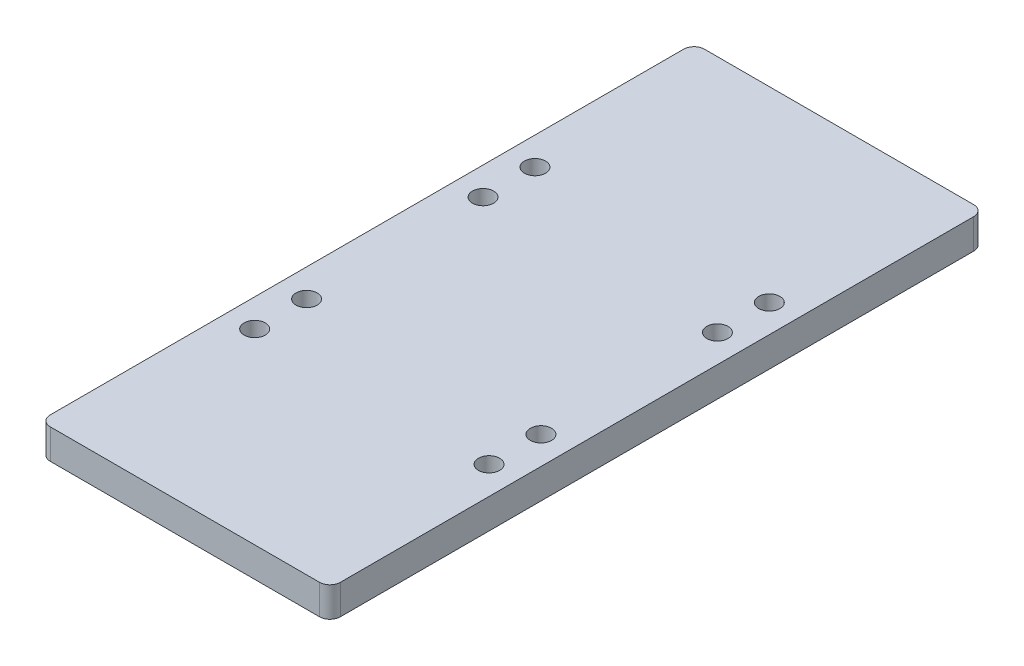
ISO-10303-21;
HEADER;
FILE_DESCRIPTION(('STEP AP214'),'2;1');
FILE_NAME('part.step','',(''),(''),'','','');
FILE_SCHEMA(('AUTOMOTIVE_DESIGN { 1 0 10303 214 1 1 1 1 }'));
ENDSEC;
DATA;
#1=APPLICATION_CONTEXT('core data for automotive mechanical design processes');
#2=APPLICATION_PROTOCOL_DEFINITION('international standard','automotive_design',2000,#1);
#3=PRODUCT_CONTEXT('',#1,'mechanical');
#4=PRODUCT('Part','Part','',(#3));
#5=PRODUCT_RELATED_PRODUCT_CATEGORY('part','',(#4));
#6=PRODUCT_DEFINITION_FORMATION('','',#4);
#7=PRODUCT_DEFINITION_CONTEXT('part definition',#1,'design');
#8=PRODUCT_DEFINITION('design','',#6,#7);
#9=PRODUCT_DEFINITION_SHAPE('','',#8);
#10=(LENGTH_UNIT() NAMED_UNIT(*) SI_UNIT(.MILLI.,.METRE.));
#11=(NAMED_UNIT(*) PLANE_ANGLE_UNIT() SI_UNIT($,.RADIAN.));
#12=(NAMED_UNIT(*) SI_UNIT($,.STERADIAN.) SOLID_ANGLE_UNIT());
#13=UNCERTAINTY_MEASURE_WITH_UNIT(LENGTH_MEASURE(1.E-05),#10,'distance_accuracy_value','');
#14=(GEOMETRIC_REPRESENTATION_CONTEXT(3) GLOBAL_UNCERTAINTY_ASSIGNED_CONTEXT((#13)) GLOBAL_UNIT_ASSIGNED_CONTEXT((#10,
#11,#12)) REPRESENTATION_CONTEXT('',''));
#15=CARTESIAN_POINT('',(0.,0.,0.));
#16=DIRECTION('',(0.,0.,1.));
#17=DIRECTION('',(1.,0.,0.));
#18=AXIS2_PLACEMENT_3D('',#15,#16,#17);
#19=CARTESIAN_POINT('',(-35.473,7.3152,80.));
#20=DIRECTION('',(1.,0.,0.));
#21=DIRECTION('',(0.,0.,-1.));
#22=AXIS2_PLACEMENT_3D('',#19,#20,#21);
#23=PLANE('',#22);
#24=DIRECTION('',(0.,0.,1.));
#25=VECTOR('',#24,1.);
#26=CARTESIAN_POINT('',(-35.473,0.,80.));
#27=LINE('',#26,#25);
#28=CARTESIAN_POINT('',(-35.473,0.,-77.46));
#29=VERTEX_POINT('',#28);
#30=CARTESIAN_POINT('',(-35.473,0.,77.46));
#31=VERTEX_POINT('',#30);
#32=EDGE_CURVE('E134',#29,#31,#27,.T.);
#33=ORIENTED_EDGE('',*,*,#32,.T.);
#34=DIRECTION('',(0.,-1.,0.));
#35=VECTOR('',#34,1.);
#36=CARTESIAN_POINT('',(-35.473,7.3152,77.46));
#37=LINE('',#36,#35);
#38=CARTESIAN_POINT('',(-35.473,7.3152,77.46));
#39=VERTEX_POINT('',#38);
#40=EDGE_CURVE('E157',#31,#39,#37,.F.);
#41=ORIENTED_EDGE('',*,*,#40,.T.);
#42=DIRECTION('',(0.,0.,1.));
#43=VECTOR('',#42,1.);
#44=CARTESIAN_POINT('',(-35.473,7.3152,80.));
#45=LINE('',#44,#43);
#46=CARTESIAN_POINT('',(-35.473,7.3152,-77.46));
#47=VERTEX_POINT('',#46);
#48=EDGE_CURVE('E132',#47,#39,#45,.T.);
#49=ORIENTED_EDGE('',*,*,#48,.F.);
#50=DIRECTION('',(0.,-1.,0.));
#51=VECTOR('',#50,1.);
#52=CARTESIAN_POINT('',(-35.473,7.3152,-77.46));
#53=LINE('',#52,#51);
#54=EDGE_CURVE('E154',#47,#29,#53,.T.);
#55=ORIENTED_EDGE('',*,*,#54,.T.);
#56=EDGE_LOOP('',(#33,#41,#49,#55));
#57=FACE_BOUND('',#56,.T.);
#58=ADVANCED_FACE('F39',(#57),#23,.F.);
#59=CARTESIAN_POINT('',(35.473,7.3152,80.));
#60=DIRECTION('',(0.,0.,-1.));
#61=DIRECTION('',(-1.,0.,0.));
#62=AXIS2_PLACEMENT_3D('',#59,#60,#61);
#63=PLANE('',#62);
#64=DIRECTION('',(1.,0.,0.));
#65=VECTOR('',#64,1.);
#66=CARTESIAN_POINT('',(35.473,0.,80.));
#67=LINE('',#66,#65);
#68=CARTESIAN_POINT('',(-32.933,0.,80.));
#69=VERTEX_POINT('',#68);
#70=CARTESIAN_POINT('',(32.933,0.,80.));
#71=VERTEX_POINT('',#70);
#72=EDGE_CURVE('E130',#69,#71,#67,.T.);
#73=ORIENTED_EDGE('',*,*,#72,.T.);
#74=DIRECTION('',(0.,-1.,0.));
#75=VECTOR('',#74,1.);
#76=CARTESIAN_POINT('',(32.933,7.3152,80.));
#77=LINE('',#76,#75);
#78=CARTESIAN_POINT('',(32.933,7.3152,80.));
#79=VERTEX_POINT('',#78);
#80=EDGE_CURVE('E109',#71,#79,#77,.F.);
#81=ORIENTED_EDGE('',*,*,#80,.T.);
#82=DIRECTION('',(1.,0.,0.));
#83=VECTOR('',#82,1.);
#84=CARTESIAN_POINT('',(35.473,7.3152,80.));
#85=LINE('',#84,#83);
#86=CARTESIAN_POINT('',(-32.933,7.3152,80.));
#87=VERTEX_POINT('',#86);
#88=EDGE_CURVE('E173',#87,#79,#85,.T.);
#89=ORIENTED_EDGE('',*,*,#88,.F.);
#90=DIRECTION('',(0.,-1.,0.));
#91=VECTOR('',#90,1.);
#92=CARTESIAN_POINT('',(-32.933,7.3152,80.));
#93=LINE('',#92,#91);
#94=EDGE_CURVE('E114',#87,#69,#93,.T.);
#95=ORIENTED_EDGE('',*,*,#94,.T.);
#96=EDGE_LOOP('',(#73,#81,#89,#95));
#97=FACE_BOUND('',#96,.T.);
#98=ADVANCED_FACE('F254',(#97),#63,.F.);
#99=CARTESIAN_POINT('',(35.473,7.3152,80.));
#100=DIRECTION('',(-1.,0.,0.));
#101=DIRECTION('',(0.,0.,1.));
#102=AXIS2_PLACEMENT_3D('',#99,#100,#101);
#103=PLANE('',#102);
#104=DIRECTION('',(0.,0.,-1.));
#105=VECTOR('',#104,1.);
#106=CARTESIAN_POINT('',(35.473,7.3152,80.));
#107=LINE('',#106,#105);
#108=CARTESIAN_POINT('',(35.473,7.3152,77.46));
#109=VERTEX_POINT('',#108);
#110=CARTESIAN_POINT('',(35.473,7.3152,-77.46));
#111=VERTEX_POINT('',#110);
#112=EDGE_CURVE('E123',#109,#111,#107,.T.);
#113=ORIENTED_EDGE('',*,*,#112,.F.);
#114=DIRECTION('',(0.,-1.,0.));
#115=VECTOR('',#114,1.);
#116=CARTESIAN_POINT('',(35.473,7.3152,77.46));
#117=LINE('',#116,#115);
#118=CARTESIAN_POINT('',(35.473,0.,77.46));
#119=VERTEX_POINT('',#118);
#120=EDGE_CURVE('E108',#109,#119,#117,.T.);
#121=ORIENTED_EDGE('',*,*,#120,.T.);
#122=DIRECTION('',(0.,0.,-1.));
#123=VECTOR('',#122,1.);
#124=CARTESIAN_POINT('',(35.473,0.,80.));
#125=LINE('',#124,#123);
#126=CARTESIAN_POINT('',(35.473,0.,-77.46));
#127=VERTEX_POINT('',#126);
#128=EDGE_CURVE('E121',#119,#127,#125,.T.);
#129=ORIENTED_EDGE('',*,*,#128,.T.);
#130=DIRECTION('',(0.,-1.,0.));
#131=VECTOR('',#130,1.);
#132=CARTESIAN_POINT('',(35.473,7.3152,-77.46));
#133=LINE('',#132,#131);
#134=EDGE_CURVE('E125',#127,#111,#133,.F.);
#135=ORIENTED_EDGE('',*,*,#134,.T.);
#136=EDGE_LOOP('',(#113,#121,#129,#135));
#137=FACE_BOUND('',#136,.T.);
#138=ADVANCED_FACE('F120',(#137),#103,.F.);
#139=CARTESIAN_POINT('',(35.473,7.3152,-80.));
#140=DIRECTION('',(0.,0.,1.));
#141=DIRECTION('',(1.,0.,0.));
#142=AXIS2_PLACEMENT_3D('',#139,#140,#141);
#143=PLANE('',#142);
#144=DIRECTION('',(-1.,0.,0.));
#145=VECTOR('',#144,1.);
#146=CARTESIAN_POINT('',(35.473,0.,-80.));
#147=LINE('',#146,#145);
#148=CARTESIAN_POINT('',(32.933,0.,-80.));
#149=VERTEX_POINT('',#148);
#150=CARTESIAN_POINT('',(-32.933,0.,-80.));
#151=VERTEX_POINT('',#150);
#152=EDGE_CURVE('E129',#149,#151,#147,.T.);
#153=ORIENTED_EDGE('',*,*,#152,.T.);
#154=DIRECTION('',(0.,-1.,0.));
#155=VECTOR('',#154,1.);
#156=CARTESIAN_POINT('',(-32.933,7.3152,-80.));
#157=LINE('',#156,#155);
#158=CARTESIAN_POINT('',(-32.933,7.3152,-80.));
#159=VERTEX_POINT('',#158);
#160=EDGE_CURVE('E11',#151,#159,#157,.F.);
#161=ORIENTED_EDGE('',*,*,#160,.T.);
#162=DIRECTION('',(-1.,0.,0.));
#163=VECTOR('',#162,1.);
#164=CARTESIAN_POINT('',(35.473,7.3152,-80.));
#165=LINE('',#164,#163);
#166=CARTESIAN_POINT('',(32.933,7.3152,-80.));
#167=VERTEX_POINT('',#166);
#168=EDGE_CURVE('E138',#167,#159,#165,.T.);
#169=ORIENTED_EDGE('',*,*,#168,.F.);
#170=DIRECTION('',(0.,-1.,0.));
#171=VECTOR('',#170,1.);
#172=CARTESIAN_POINT('',(32.933,7.3152,-80.));
#173=LINE('',#172,#171);
#174=EDGE_CURVE('E47',#167,#149,#173,.T.);
#175=ORIENTED_EDGE('',*,*,#174,.T.);
#176=EDGE_LOOP('',(#153,#161,#169,#175));
#177=FACE_BOUND('',#176,.T.);
#178=ADVANCED_FACE('F160',(#177),#143,.F.);
#179=CARTESIAN_POINT('',(0.,7.3152,0.));
#180=DIRECTION('',(0.,1.,0.));
#181=DIRECTION('',(0.,0.,1.));
#182=AXIS2_PLACEMENT_3D('',#179,#180,#181);
#183=PLANE('',#182);
#184=CARTESIAN_POINT('',(-28.6626,7.3152,-34.28));
#185=DIRECTION('',(0.,1.,0.));
#186=DIRECTION('',(0.,0.,1.));
#187=AXIS2_PLACEMENT_3D('',#184,#185,#186);
#188=CIRCLE('',#187,2.59079999999999);
#189=CARTESIAN_POINT('',(-28.6626,7.3152,-31.6892));
#190=VERTEX_POINT('',#189);
#191=EDGE_CURVE('E229',#190,#190,#188,.T.);
#192=ORIENTED_EDGE('',*,*,#191,.F.);
#193=EDGE_LOOP('',(#192));
#194=FACE_BOUND('',#193,.T.);
#195=CARTESIAN_POINT('',(-28.6626,7.3152,-21.58));
#196=DIRECTION('',(0.,1.,0.));
#197=DIRECTION('',(0.,0.,1.));
#198=AXIS2_PLACEMENT_3D('',#195,#196,#197);
#199=CIRCLE('',#198,2.59079999999999);
#200=CARTESIAN_POINT('',(-28.6626,7.3152,-18.9892));
#201=VERTEX_POINT('',#200);
#202=EDGE_CURVE('E223',#201,#201,#199,.T.);
#203=ORIENTED_EDGE('',*,*,#202,.F.);
#204=EDGE_LOOP('',(#203));
#205=FACE_BOUND('',#204,.T.);
#206=CARTESIAN_POINT('',(28.6626,7.3152,-34.28));
#207=DIRECTION('',(0.,1.,0.));
#208=DIRECTION('',(0.,0.,1.));
#209=AXIS2_PLACEMENT_3D('',#206,#207,#208);
#210=CIRCLE('',#209,2.59079999999998);
#211=CARTESIAN_POINT('',(28.6626,7.3152,-31.6892));
#212=VERTEX_POINT('',#211);
#213=EDGE_CURVE('E217',#212,#212,#210,.T.);
#214=ORIENTED_EDGE('',*,*,#213,.F.);
#215=EDGE_LOOP('',(#214));
#216=FACE_BOUND('',#215,.T.);
#217=CARTESIAN_POINT('',(28.6626,7.3152,-21.58));
#218=DIRECTION('',(0.,1.,0.));
#219=DIRECTION('',(0.,0.,1.));
#220=AXIS2_PLACEMENT_3D('',#217,#218,#219);
#221=CIRCLE('',#220,2.59079999999998);
#222=CARTESIAN_POINT('',(28.6626,7.3152,-18.9892));
#223=VERTEX_POINT('',#222);
#224=EDGE_CURVE('E211',#223,#223,#221,.T.);
#225=ORIENTED_EDGE('',*,*,#224,.F.);
#226=EDGE_LOOP('',(#225));
#227=FACE_BOUND('',#226,.T.);
#228=CARTESIAN_POINT('',(28.6626,7.3152,34.28));
#229=DIRECTION('',(0.,1.,0.));
#230=DIRECTION('',(0.,0.,1.));
#231=AXIS2_PLACEMENT_3D('',#228,#229,#230);
#232=CIRCLE('',#231,2.59079999999998);
#233=CARTESIAN_POINT('',(28.6626,7.3152,36.8708));
#234=VERTEX_POINT('',#233);
#235=EDGE_CURVE('E205',#234,#234,#232,.T.);
#236=ORIENTED_EDGE('',*,*,#235,.F.);
#237=EDGE_LOOP('',(#236));
#238=FACE_BOUND('',#237,.T.);
#239=CARTESIAN_POINT('',(28.6626,7.3152,21.58));
#240=DIRECTION('',(0.,1.,0.));
#241=DIRECTION('',(0.,0.,1.));
#242=AXIS2_PLACEMENT_3D('',#239,#240,#241);
#243=CIRCLE('',#242,2.59079999999998);
#244=CARTESIAN_POINT('',(28.6626,7.3152,24.1708));
#245=VERTEX_POINT('',#244);
#246=EDGE_CURVE('E199',#245,#245,#243,.T.);
#247=ORIENTED_EDGE('',*,*,#246,.F.);
#248=EDGE_LOOP('',(#247));
#249=FACE_BOUND('',#248,.T.);
#250=CARTESIAN_POINT('',(-28.6626,7.3152,34.28));
#251=DIRECTION('',(0.,1.,0.));
#252=DIRECTION('',(0.,0.,1.));
#253=AXIS2_PLACEMENT_3D('',#250,#251,#252);
#254=CIRCLE('',#253,2.59079999999999);
#255=CARTESIAN_POINT('',(-28.6626,7.3152,36.8708));
#256=VERTEX_POINT('',#255);
#257=EDGE_CURVE('E191',#256,#256,#254,.T.);
#258=ORIENTED_EDGE('',*,*,#257,.F.);
#259=EDGE_LOOP('',(#258));
#260=FACE_BOUND('',#259,.T.);
#261=CARTESIAN_POINT('',(-28.6626,7.3152,21.58));
#262=DIRECTION('',(0.,1.,0.));
#263=DIRECTION('',(0.,0.,1.));
#264=AXIS2_PLACEMENT_3D('',#261,#262,#263);
#265=CIRCLE('',#264,2.59079999999999);
#266=CARTESIAN_POINT('',(-28.6626,7.3152,24.1708));
#267=VERTEX_POINT('',#266);
#268=EDGE_CURVE('E183',#267,#267,#265,.T.);
#269=ORIENTED_EDGE('',*,*,#268,.F.);
#270=EDGE_LOOP('',(#269));
#271=FACE_BOUND('',#270,.T.);
#272=ORIENTED_EDGE('',*,*,#88,.T.);
#273=CARTESIAN_POINT('',(32.933,7.3152,77.46));
#274=DIRECTION('',(0.,1.,0.));
#275=DIRECTION('',(0.,0.,1.));
#276=AXIS2_PLACEMENT_3D('',#273,#274,#275);
#277=CIRCLE('',#276,2.54);
#278=EDGE_CURVE('E152',#79,#109,#277,.T.);
#279=ORIENTED_EDGE('',*,*,#278,.T.);
#280=ORIENTED_EDGE('',*,*,#112,.T.);
#281=CARTESIAN_POINT('',(32.933,7.3152,-77.46));
#282=DIRECTION('',(0.,1.,0.));
#283=DIRECTION('',(0.,0.,1.));
#284=AXIS2_PLACEMENT_3D('',#281,#282,#283);
#285=CIRCLE('',#284,2.54);
#286=EDGE_CURVE('E59',#111,#167,#285,.T.);
#287=ORIENTED_EDGE('',*,*,#286,.T.);
#288=ORIENTED_EDGE('',*,*,#168,.T.);
#289=CARTESIAN_POINT('',(-32.933,7.3152,-77.46));
#290=DIRECTION('',(0.,1.,0.));
#291=DIRECTION('',(0.,0.,1.));
#292=AXIS2_PLACEMENT_3D('',#289,#290,#291);
#293=CIRCLE('',#292,2.54);
#294=EDGE_CURVE('E148',#159,#47,#293,.T.);
#295=ORIENTED_EDGE('',*,*,#294,.T.);
#296=ORIENTED_EDGE('',*,*,#48,.T.);
#297=CARTESIAN_POINT('',(-32.933,7.3152,77.46));
#298=DIRECTION('',(0.,1.,0.));
#299=DIRECTION('',(0.,0.,1.));
#300=AXIS2_PLACEMENT_3D('',#297,#298,#299);
#301=CIRCLE('',#300,2.54);
#302=EDGE_CURVE('E150',#39,#87,#301,.T.);
#303=ORIENTED_EDGE('',*,*,#302,.T.);
#304=EDGE_LOOP('',(#272,#279,#280,#287,#288,#295,#296,#303));
#305=FACE_BOUND('',#304,.T.);
#306=ADVANCED_FACE('F235',(#194,#205,#216,#227,#238,#249,#260,#271,#305),#183,.T.);
#307=CARTESIAN_POINT('',(0.,0.,0.));
#308=DIRECTION('',(0.,1.,0.));
#309=DIRECTION('',(0.,0.,1.));
#310=AXIS2_PLACEMENT_3D('',#307,#308,#309);
#311=PLANE('',#310);
#312=CARTESIAN_POINT('',(-28.6626,0.,-34.28));
#313=DIRECTION('',(0.,1.,0.));
#314=DIRECTION('',(0.,0.,1.));
#315=AXIS2_PLACEMENT_3D('',#312,#313,#314);
#316=CIRCLE('',#315,2.59079999999995);
#317=CARTESIAN_POINT('',(-28.6626,0.,-31.6892000000001));
#318=VERTEX_POINT('',#317);
#319=EDGE_CURVE('E226',#318,#318,#316,.T.);
#320=ORIENTED_EDGE('',*,*,#319,.T.);
#321=EDGE_LOOP('',(#320));
#322=FACE_BOUND('',#321,.T.);
#323=CARTESIAN_POINT('',(-28.6626,0.,-21.58));
#324=DIRECTION('',(0.,1.,0.));
#325=DIRECTION('',(0.,0.,1.));
#326=AXIS2_PLACEMENT_3D('',#323,#324,#325);
#327=CIRCLE('',#326,2.59079999999995);
#328=CARTESIAN_POINT('',(-28.6626,0.,-18.9892000000001));
#329=VERTEX_POINT('',#328);
#330=EDGE_CURVE('E220',#329,#329,#327,.T.);
#331=ORIENTED_EDGE('',*,*,#330,.T.);
#332=EDGE_LOOP('',(#331));
#333=FACE_BOUND('',#332,.T.);
#334=CARTESIAN_POINT('',(28.6626,0.,-34.28));
#335=DIRECTION('',(0.,1.,0.));
#336=DIRECTION('',(0.,0.,1.));
#337=AXIS2_PLACEMENT_3D('',#334,#335,#336);
#338=CIRCLE('',#337,2.59079999999996);
#339=CARTESIAN_POINT('',(28.6626,0.,-31.6892000000001));
#340=VERTEX_POINT('',#339);
#341=EDGE_CURVE('E214',#340,#340,#338,.T.);
#342=ORIENTED_EDGE('',*,*,#341,.T.);
#343=EDGE_LOOP('',(#342));
#344=FACE_BOUND('',#343,.T.);
#345=CARTESIAN_POINT('',(28.6626,0.,-21.58));
#346=DIRECTION('',(0.,1.,0.));
#347=DIRECTION('',(0.,0.,1.));
#348=AXIS2_PLACEMENT_3D('',#345,#346,#347);
#349=CIRCLE('',#348,2.59079999999996);
#350=CARTESIAN_POINT('',(28.6626,0.,-18.9892000000001));
#351=VERTEX_POINT('',#350);
#352=EDGE_CURVE('E208',#351,#351,#349,.T.);
#353=ORIENTED_EDGE('',*,*,#352,.T.);
#354=EDGE_LOOP('',(#353));
#355=FACE_BOUND('',#354,.T.);
#356=CARTESIAN_POINT('',(28.6626,0.,34.28));
#357=DIRECTION('',(0.,1.,0.));
#358=DIRECTION('',(0.,0.,1.));
#359=AXIS2_PLACEMENT_3D('',#356,#357,#358);
#360=CIRCLE('',#359,2.59079999999996);
#361=CARTESIAN_POINT('',(28.6626,0.,36.8708));
#362=VERTEX_POINT('',#361);
#363=EDGE_CURVE('E202',#362,#362,#360,.T.);
#364=ORIENTED_EDGE('',*,*,#363,.T.);
#365=EDGE_LOOP('',(#364));
#366=FACE_BOUND('',#365,.T.);
#367=CARTESIAN_POINT('',(28.6626,0.,21.58));
#368=DIRECTION('',(0.,1.,0.));
#369=DIRECTION('',(0.,0.,1.));
#370=AXIS2_PLACEMENT_3D('',#367,#368,#369);
#371=CIRCLE('',#370,2.59079999999996);
#372=CARTESIAN_POINT('',(28.6626,0.,24.1708));
#373=VERTEX_POINT('',#372);
#374=EDGE_CURVE('E196',#373,#373,#371,.T.);
#375=ORIENTED_EDGE('',*,*,#374,.T.);
#376=EDGE_LOOP('',(#375));
#377=FACE_BOUND('',#376,.T.);
#378=CARTESIAN_POINT('',(-28.6626,0.,34.28));
#379=DIRECTION('',(0.,1.,0.));
#380=DIRECTION('',(0.,0.,1.));
#381=AXIS2_PLACEMENT_3D('',#378,#379,#380);
#382=CIRCLE('',#381,2.59079999999995);
#383=CARTESIAN_POINT('',(-28.6626,0.,36.8708));
#384=VERTEX_POINT('',#383);
#385=EDGE_CURVE('E187',#384,#384,#382,.T.);
#386=ORIENTED_EDGE('',*,*,#385,.T.);
#387=EDGE_LOOP('',(#386));
#388=FACE_BOUND('',#387,.T.);
#389=CARTESIAN_POINT('',(-28.6626,0.,21.58));
#390=DIRECTION('',(0.,1.,0.));
#391=DIRECTION('',(0.,0.,1.));
#392=AXIS2_PLACEMENT_3D('',#389,#390,#391);
#393=CIRCLE('',#392,2.59079999999995);
#394=CARTESIAN_POINT('',(-28.6626,0.,24.1708));
#395=VERTEX_POINT('',#394);
#396=EDGE_CURVE('E178',#395,#395,#393,.T.);
#397=ORIENTED_EDGE('',*,*,#396,.T.);
#398=EDGE_LOOP('',(#397));
#399=FACE_BOUND('',#398,.T.);
#400=ORIENTED_EDGE('',*,*,#128,.F.);
#401=CARTESIAN_POINT('',(32.933,0.,77.46));
#402=DIRECTION('',(0.,1.,0.));
#403=DIRECTION('',(0.,0.,1.));
#404=AXIS2_PLACEMENT_3D('',#401,#402,#403);
#405=CIRCLE('',#404,2.54);
#406=EDGE_CURVE('E104',#119,#71,#405,.F.);
#407=ORIENTED_EDGE('',*,*,#406,.T.);
#408=ORIENTED_EDGE('',*,*,#72,.F.);
#409=CARTESIAN_POINT('',(-32.933,0.,77.46));
#410=DIRECTION('',(0.,1.,0.));
#411=DIRECTION('',(0.,0.,1.));
#412=AXIS2_PLACEMENT_3D('',#409,#410,#411);
#413=CIRCLE('',#412,2.54);
#414=EDGE_CURVE('E115',#69,#31,#413,.F.);
#415=ORIENTED_EDGE('',*,*,#414,.T.);
#416=ORIENTED_EDGE('',*,*,#32,.F.);
#417=CARTESIAN_POINT('',(-32.933,0.,-77.46));
#418=DIRECTION('',(0.,1.,0.));
#419=DIRECTION('',(0.,0.,1.));
#420=AXIS2_PLACEMENT_3D('',#417,#418,#419);
#421=CIRCLE('',#420,2.54);
#422=EDGE_CURVE('E141',#29,#151,#421,.F.);
#423=ORIENTED_EDGE('',*,*,#422,.T.);
#424=ORIENTED_EDGE('',*,*,#152,.F.);
#425=CARTESIAN_POINT('',(32.933,0.,-77.46));
#426=DIRECTION('',(0.,1.,0.));
#427=DIRECTION('',(0.,0.,1.));
#428=AXIS2_PLACEMENT_3D('',#425,#426,#427);
#429=CIRCLE('',#428,2.54);
#430=EDGE_CURVE('E124',#149,#127,#429,.F.);
#431=ORIENTED_EDGE('',*,*,#430,.T.);
#432=EDGE_LOOP('',(#400,#407,#408,#415,#416,#423,#424,#431));
#433=FACE_BOUND('',#432,.T.);
#434=ADVANCED_FACE('F127',(#322,#333,#344,#355,#366,#377,#388,#399,#433),#311,.F.);
#435=CARTESIAN_POINT('',(-28.6626,7.3152,21.58));
#436=DIRECTION('',(0.,1.,0.));
#437=DIRECTION('',(0.,0.,1.));
#438=AXIS2_PLACEMENT_3D('',#435,#436,#437);
#439=CYLINDRICAL_SURFACE('',#438,2.59079999999997);
#440=ORIENTED_EDGE('',*,*,#396,.F.);
#441=EDGE_LOOP('',(#440));
#442=FACE_BOUND('',#441,.T.);
#443=ORIENTED_EDGE('',*,*,#268,.T.);
#444=EDGE_LOOP('',(#443));
#445=FACE_BOUND('',#444,.T.);
#446=ADVANCED_FACE('F277',(#442,#445),#439,.F.);
#447=CARTESIAN_POINT('',(-28.6626,7.3152,34.28));
#448=DIRECTION('',(0.,1.,0.));
#449=DIRECTION('',(0.,0.,1.));
#450=AXIS2_PLACEMENT_3D('',#447,#448,#449);
#451=CYLINDRICAL_SURFACE('',#450,2.59079999999997);
#452=ORIENTED_EDGE('',*,*,#385,.F.);
#453=EDGE_LOOP('',(#452));
#454=FACE_BOUND('',#453,.T.);
#455=ORIENTED_EDGE('',*,*,#257,.T.);
#456=EDGE_LOOP('',(#455));
#457=FACE_BOUND('',#456,.T.);
#458=ADVANCED_FACE('F282',(#454,#457),#451,.F.);
#459=CARTESIAN_POINT('',(28.6626,7.3152,21.58));
#460=DIRECTION('',(0.,1.,0.));
#461=DIRECTION('',(0.,0.,1.));
#462=AXIS2_PLACEMENT_3D('',#459,#460,#461);
#463=CYLINDRICAL_SURFACE('',#462,2.59079999999997);
#464=ORIENTED_EDGE('',*,*,#374,.F.);
#465=EDGE_LOOP('',(#464));
#466=FACE_BOUND('',#465,.T.);
#467=ORIENTED_EDGE('',*,*,#246,.T.);
#468=EDGE_LOOP('',(#467));
#469=FACE_BOUND('',#468,.T.);
#470=ADVANCED_FACE('F286',(#466,#469),#463,.F.);
#471=CARTESIAN_POINT('',(28.6626,7.3152,34.28));
#472=DIRECTION('',(0.,1.,0.));
#473=DIRECTION('',(0.,0.,1.));
#474=AXIS2_PLACEMENT_3D('',#471,#472,#473);
#475=CYLINDRICAL_SURFACE('',#474,2.59079999999997);
#476=ORIENTED_EDGE('',*,*,#363,.F.);
#477=EDGE_LOOP('',(#476));
#478=FACE_BOUND('',#477,.T.);
#479=ORIENTED_EDGE('',*,*,#235,.T.);
#480=EDGE_LOOP('',(#479));
#481=FACE_BOUND('',#480,.T.);
#482=ADVANCED_FACE('F263',(#478,#481),#475,.F.);
#483=CARTESIAN_POINT('',(32.933,7.3152,77.46));
#484=DIRECTION('',(0.,-1.,0.));
#485=DIRECTION('',(0.,0.,-1.));
#486=AXIS2_PLACEMENT_3D('',#483,#484,#485);
#487=CYLINDRICAL_SURFACE('',#486,2.54);
#488=ORIENTED_EDGE('',*,*,#278,.F.);
#489=ORIENTED_EDGE('',*,*,#80,.F.);
#490=ORIENTED_EDGE('',*,*,#406,.F.);
#491=ORIENTED_EDGE('',*,*,#120,.F.);
#492=EDGE_LOOP('',(#488,#489,#490,#491));
#493=FACE_BOUND('',#492,.T.);
#494=ADVANCED_FACE('F107',(#493),#487,.T.);
#495=CARTESIAN_POINT('',(-32.933,7.3152,77.46));
#496=DIRECTION('',(0.,-1.,0.));
#497=DIRECTION('',(0.,0.,-1.));
#498=AXIS2_PLACEMENT_3D('',#495,#496,#497);
#499=CYLINDRICAL_SURFACE('',#498,2.54);
#500=ORIENTED_EDGE('',*,*,#302,.F.);
#501=ORIENTED_EDGE('',*,*,#40,.F.);
#502=ORIENTED_EDGE('',*,*,#414,.F.);
#503=ORIENTED_EDGE('',*,*,#94,.F.);
#504=EDGE_LOOP('',(#500,#501,#502,#503));
#505=FACE_BOUND('',#504,.T.);
#506=ADVANCED_FACE('F256',(#505),#499,.T.);
#507=CARTESIAN_POINT('',(-32.933,7.3152,-77.46));
#508=DIRECTION('',(0.,-1.,0.));
#509=DIRECTION('',(0.,0.,-1.));
#510=AXIS2_PLACEMENT_3D('',#507,#508,#509);
#511=CYLINDRICAL_SURFACE('',#510,2.54);
#512=ORIENTED_EDGE('',*,*,#294,.F.);
#513=ORIENTED_EDGE('',*,*,#160,.F.);
#514=ORIENTED_EDGE('',*,*,#422,.F.);
#515=ORIENTED_EDGE('',*,*,#54,.F.);
#516=EDGE_LOOP('',(#512,#513,#514,#515));
#517=FACE_BOUND('',#516,.T.);
#518=ADVANCED_FACE('F167',(#517),#511,.T.);
#519=CARTESIAN_POINT('',(32.933,7.3152,-77.46));
#520=DIRECTION('',(0.,-1.,0.));
#521=DIRECTION('',(0.,0.,-1.));
#522=AXIS2_PLACEMENT_3D('',#519,#520,#521);
#523=CYLINDRICAL_SURFACE('',#522,2.54);
#524=ORIENTED_EDGE('',*,*,#286,.F.);
#525=ORIENTED_EDGE('',*,*,#134,.F.);
#526=ORIENTED_EDGE('',*,*,#430,.F.);
#527=ORIENTED_EDGE('',*,*,#174,.F.);
#528=EDGE_LOOP('',(#524,#525,#526,#527));
#529=FACE_BOUND('',#528,.T.);
#530=ADVANCED_FACE('F41',(#529),#523,.T.);
#531=CARTESIAN_POINT('',(28.6626,7.3152,-21.58));
#532=DIRECTION('',(0.,1.,0.));
#533=DIRECTION('',(0.,0.,1.));
#534=AXIS2_PLACEMENT_3D('',#531,#532,#533);
#535=CYLINDRICAL_SURFACE('',#534,2.59079999999997);
#536=ORIENTED_EDGE('',*,*,#352,.F.);
#537=EDGE_LOOP('',(#536));
#538=FACE_BOUND('',#537,.T.);
#539=ORIENTED_EDGE('',*,*,#224,.T.);
#540=EDGE_LOOP('',(#539));
#541=FACE_BOUND('',#540,.T.);
#542=ADVANCED_FACE('F294',(#538,#541),#535,.F.);
#543=CARTESIAN_POINT('',(28.6626,7.3152,-34.28));
#544=DIRECTION('',(0.,1.,0.));
#545=DIRECTION('',(0.,0.,1.));
#546=AXIS2_PLACEMENT_3D('',#543,#544,#545);
#547=CYLINDRICAL_SURFACE('',#546,2.59079999999997);
#548=ORIENTED_EDGE('',*,*,#341,.F.);
#549=EDGE_LOOP('',(#548));
#550=FACE_BOUND('',#549,.T.);
#551=ORIENTED_EDGE('',*,*,#213,.T.);
#552=EDGE_LOOP('',(#551));
#553=FACE_BOUND('',#552,.T.);
#554=ADVANCED_FACE('F297',(#550,#553),#547,.F.);
#555=CARTESIAN_POINT('',(-28.6626,7.3152,-21.58));
#556=DIRECTION('',(0.,1.,0.));
#557=DIRECTION('',(0.,0.,1.));
#558=AXIS2_PLACEMENT_3D('',#555,#556,#557);
#559=CYLINDRICAL_SURFACE('',#558,2.59079999999997);
#560=ORIENTED_EDGE('',*,*,#330,.F.);
#561=EDGE_LOOP('',(#560));
#562=FACE_BOUND('',#561,.T.);
#563=ORIENTED_EDGE('',*,*,#202,.T.);
#564=EDGE_LOOP('',(#563));
#565=FACE_BOUND('',#564,.T.);
#566=ADVANCED_FACE('F301',(#562,#565),#559,.F.);
#567=CARTESIAN_POINT('',(-28.6626,7.3152,-34.28));
#568=DIRECTION('',(0.,1.,0.));
#569=DIRECTION('',(0.,0.,1.));
#570=AXIS2_PLACEMENT_3D('',#567,#568,#569);
#571=CYLINDRICAL_SURFACE('',#570,2.59079999999997);
#572=ORIENTED_EDGE('',*,*,#319,.F.);
#573=EDGE_LOOP('',(#572));
#574=FACE_BOUND('',#573,.T.);
#575=ORIENTED_EDGE('',*,*,#191,.T.);
#576=EDGE_LOOP('',(#575));
#577=FACE_BOUND('',#576,.T.);
#578=ADVANCED_FACE('F233',(#574,#577),#571,.F.);
#579=CLOSED_SHELL('',(#58,#98,#138,#178,#306,#434,#446,#458,#470,#482,#494,#506,#518,#530,#542,
#554,#566,#578));
#580=MANIFOLD_SOLID_BREP('B2',#579);
#581=ADVANCED_BREP_SHAPE_REPRESENTATION('',(#18,#580),#14);
#582=SHAPE_DEFINITION_REPRESENTATION(#9,#581);
ENDSEC;
END-ISO-10303-21;
